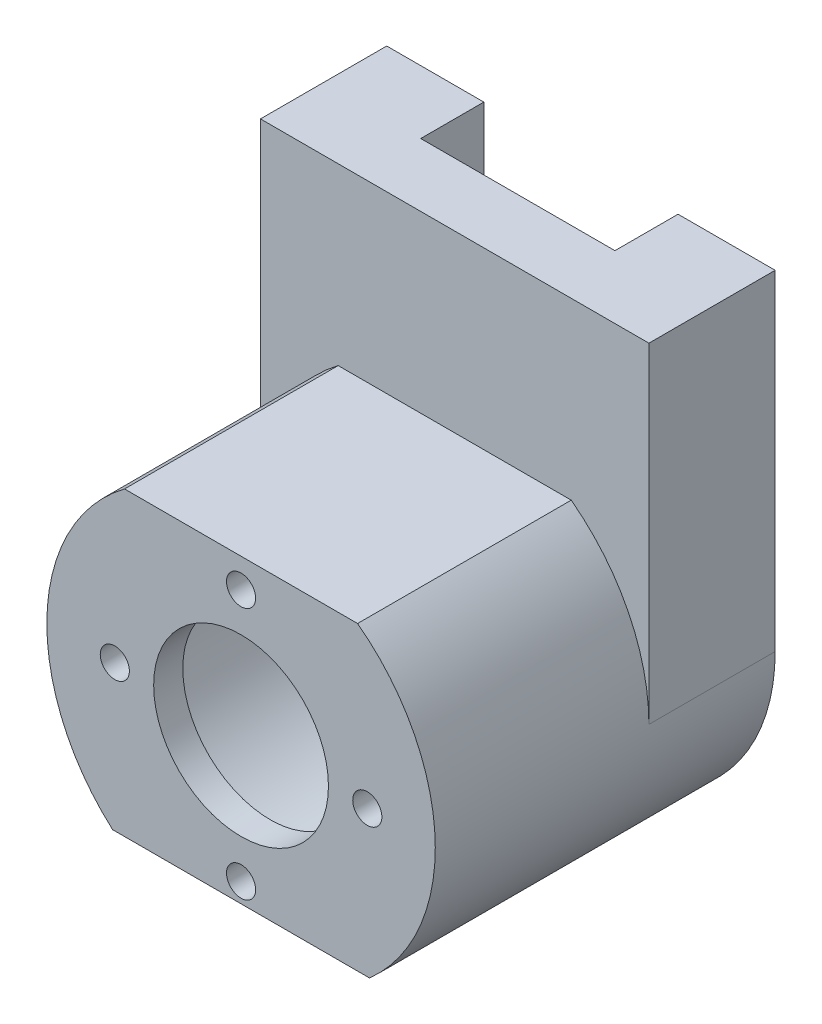
ISO-10303-21;
HEADER;
FILE_DESCRIPTION(('STEP AP214'),'2;1');
FILE_NAME('part.step','',(''),(''),'','','');
FILE_SCHEMA(('AUTOMOTIVE_DESIGN { 1 0 10303 214 1 1 1 1 }'));
ENDSEC;
DATA;
#1=APPLICATION_CONTEXT('core data for automotive mechanical design processes');
#2=APPLICATION_PROTOCOL_DEFINITION('international standard','automotive_design',2000,#1);
#3=PRODUCT_CONTEXT('',#1,'mechanical');
#4=PRODUCT('Part','Part','',(#3));
#5=PRODUCT_RELATED_PRODUCT_CATEGORY('part','',(#4));
#6=PRODUCT_DEFINITION_FORMATION('','',#4);
#7=PRODUCT_DEFINITION_CONTEXT('part definition',#1,'design');
#8=PRODUCT_DEFINITION('design','',#6,#7);
#9=PRODUCT_DEFINITION_SHAPE('','',#8);
#10=(LENGTH_UNIT() NAMED_UNIT(*) SI_UNIT(.MILLI.,.METRE.));
#11=(NAMED_UNIT(*) PLANE_ANGLE_UNIT() SI_UNIT($,.RADIAN.));
#12=(NAMED_UNIT(*) SI_UNIT($,.STERADIAN.) SOLID_ANGLE_UNIT());
#13=UNCERTAINTY_MEASURE_WITH_UNIT(LENGTH_MEASURE(1.E-05),#10,'distance_accuracy_value','');
#14=(GEOMETRIC_REPRESENTATION_CONTEXT(3) GLOBAL_UNCERTAINTY_ASSIGNED_CONTEXT((#13)) GLOBAL_UNIT_ASSIGNED_CONTEXT((#10,
#11,#12)) REPRESENTATION_CONTEXT('',''));
#15=CARTESIAN_POINT('',(0.,0.,0.));
#16=DIRECTION('',(0.,0.,1.));
#17=DIRECTION('',(1.,0.,0.));
#18=AXIS2_PLACEMENT_3D('',#15,#16,#17);
#19=CARTESIAN_POINT('',(0.,-75.,5.));
#20=DIRECTION('',(0.,0.,-1.));
#21=DIRECTION('',(-1.,0.,0.));
#22=AXIS2_PLACEMENT_3D('',#19,#20,#21);
#23=CYLINDRICAL_SURFACE('',#22,20.);
#24=DIRECTION('',(0.,0.,-1.));
#25=VECTOR('',#24,1.);
#26=CARTESIAN_POINT('',(20.,-75.,5.));
#27=LINE('',#26,#25);
#28=CARTESIAN_POINT('',(20.,-74.9999999999886,13.));
#29=VERTEX_POINT('',#28);
#30=CARTESIAN_POINT('',(20.,-75.,0.));
#31=VERTEX_POINT('',#30);
#32=EDGE_CURVE('E150',#29,#31,#27,.T.);
#33=ORIENTED_EDGE('',*,*,#32,.F.);
#34=CARTESIAN_POINT('',(0.,-75.,13.));
#35=DIRECTION('',(0.,0.,1.));
#36=DIRECTION('',(1.,0.,0.));
#37=AXIS2_PLACEMENT_3D('',#34,#35,#36);
#38=CIRCLE('',#37,20.);
#39=CARTESIAN_POINT('',(12.,-59.0000000000259,13.));
#40=VERTEX_POINT('',#39);
#41=EDGE_CURVE('E193',#40,#29,#38,.F.);
#42=ORIENTED_EDGE('',*,*,#41,.F.);
#43=DIRECTION('',(0.,0.,-1.));
#44=VECTOR('',#43,1.);
#45=CARTESIAN_POINT('',(12.,-59.,35.));
#46=LINE('',#45,#44);
#47=CARTESIAN_POINT('',(12.,-59.,35.));
#48=VERTEX_POINT('',#47);
#49=EDGE_CURVE('E137',#48,#40,#46,.T.);
#50=ORIENTED_EDGE('',*,*,#49,.F.);
#51=CARTESIAN_POINT('',(0.,-75.,35.));
#52=DIRECTION('',(0.,0.,1.));
#53=DIRECTION('',(1.,0.,0.));
#54=AXIS2_PLACEMENT_3D('',#51,#52,#53);
#55=CIRCLE('',#54,20.);
#56=CARTESIAN_POINT('',(13.228756555323,-90.,35.));
#57=VERTEX_POINT('',#56);
#58=EDGE_CURVE('E177',#57,#48,#55,.T.);
#59=ORIENTED_EDGE('',*,*,#58,.F.);
#60=CARTESIAN_POINT('',(0.,-75.,50.));
#61=DIRECTION('',(0.,0.707106781186547,-0.707106781186548));
#62=DIRECTION('',(0.,-0.707106781186548,-0.707106781186547));
#63=AXIS2_PLACEMENT_3D('',#60,#61,#62);
#64=ELLIPSE('',#63,28.2842712474619,20.);
#65=CARTESIAN_POINT('',(-13.228756555323,-90.,35.));
#66=VERTEX_POINT('',#65);
#67=EDGE_CURVE('E53',#57,#66,#64,.T.);
#68=ORIENTED_EDGE('',*,*,#67,.T.);
#69=CARTESIAN_POINT('',(-12.,-59.,35.));
#70=VERTEX_POINT('',#69);
#71=EDGE_CURVE('E169',#70,#66,#55,.T.);
#72=ORIENTED_EDGE('',*,*,#71,.F.);
#73=DIRECTION('',(0.,0.,-1.));
#74=VECTOR('',#73,1.);
#75=CARTESIAN_POINT('',(-12.,-59.,35.));
#76=LINE('',#75,#74);
#77=CARTESIAN_POINT('',(-12.,-59.,13.));
#78=VERTEX_POINT('',#77);
#79=EDGE_CURVE('E142',#70,#78,#76,.T.);
#80=ORIENTED_EDGE('',*,*,#79,.T.);
#81=CARTESIAN_POINT('',(-20.,-75.,13.));
#82=VERTEX_POINT('',#81);
#83=EDGE_CURVE('E184',#82,#78,#38,.F.);
#84=ORIENTED_EDGE('',*,*,#83,.F.);
#85=DIRECTION('',(0.,0.,-1.));
#86=VECTOR('',#85,1.);
#87=CARTESIAN_POINT('',(-20.,-75.,5.));
#88=LINE('',#87,#86);
#89=CARTESIAN_POINT('',(-20.,-75.,0.));
#90=VERTEX_POINT('',#89);
#91=EDGE_CURVE('E153',#82,#90,#88,.T.);
#92=ORIENTED_EDGE('',*,*,#91,.T.);
#93=CARTESIAN_POINT('',(0.,-75.,0.));
#94=DIRECTION('',(0.,0.,1.));
#95=DIRECTION('',(1.,0.,0.));
#96=AXIS2_PLACEMENT_3D('',#93,#94,#95);
#97=CIRCLE('',#96,20.);
#98=EDGE_CURVE('E139',#90,#31,#97,.T.);
#99=ORIENTED_EDGE('',*,*,#98,.T.);
#100=EDGE_LOOP('',(#33,#42,#50,#59,#68,#72,#80,#84,#92,#99));
#101=FACE_BOUND('',#100,.T.);
#102=ADVANCED_FACE('F31',(#101),#23,.T.);
#103=CARTESIAN_POINT('',(0.,-75.,35.));
#104=DIRECTION('',(0.,0.,-1.));
#105=DIRECTION('',(-1.,0.,0.));
#106=AXIS2_PLACEMENT_3D('',#103,#104,#105);
#107=CYLINDRICAL_SURFACE('',#106,8.99999999999999);
#108=CARTESIAN_POINT('',(0.,-75.,35.));
#109=DIRECTION('',(0.,0.,1.));
#110=DIRECTION('',(1.,0.,0.));
#111=AXIS2_PLACEMENT_3D('',#108,#109,#110);
#112=CIRCLE('',#111,8.99999999999999);
#113=CARTESIAN_POINT('',(8.99999999999999,-75.,35.));
#114=VERTEX_POINT('',#113);
#115=EDGE_CURVE('E180',#114,#114,#112,.T.);
#116=ORIENTED_EDGE('',*,*,#115,.T.);
#117=EDGE_LOOP('',(#116));
#118=FACE_BOUND('',#117,.T.);
#119=CARTESIAN_POINT('',(0.,-75.,32.));
#120=DIRECTION('',(0.,0.,-1.));
#121=DIRECTION('',(-1.,0.,0.));
#122=AXIS2_PLACEMENT_3D('',#119,#120,#121);
#123=CIRCLE('',#122,8.99999999999999);
#124=CARTESIAN_POINT('',(-8.99999999999999,-75.,32.));
#125=VERTEX_POINT('',#124);
#126=EDGE_CURVE('E224',#125,#125,#123,.T.);
#127=ORIENTED_EDGE('',*,*,#126,.T.);
#128=EDGE_LOOP('',(#127));
#129=FACE_BOUND('',#128,.T.);
#130=ADVANCED_FACE('F242',(#118,#129),#107,.F.);
#131=CARTESIAN_POINT('',(0.,-62.,35.));
#132=DIRECTION('',(0.,0.,-1.));
#133=DIRECTION('',(-1.,0.,0.));
#134=AXIS2_PLACEMENT_3D('',#131,#132,#133);
#135=CYLINDRICAL_SURFACE('',#134,1.5);
#136=CARTESIAN_POINT('',(0.,-62.,35.));
#137=DIRECTION('',(0.,0.,1.));
#138=DIRECTION('',(1.,0.,0.));
#139=AXIS2_PLACEMENT_3D('',#136,#137,#138);
#140=CIRCLE('',#139,1.5);
#141=CARTESIAN_POINT('',(1.5,-62.,35.));
#142=VERTEX_POINT('',#141);
#143=EDGE_CURVE('E235',#142,#142,#140,.T.);
#144=ORIENTED_EDGE('',*,*,#143,.T.);
#145=EDGE_LOOP('',(#144));
#146=FACE_BOUND('',#145,.T.);
#147=CARTESIAN_POINT('',(0.,-62.,32.));
#148=DIRECTION('',(0.,0.,-1.));
#149=DIRECTION('',(-1.,0.,0.));
#150=AXIS2_PLACEMENT_3D('',#147,#148,#149);
#151=CIRCLE('',#150,1.5);
#152=CARTESIAN_POINT('',(-1.5,-62.,32.));
#153=VERTEX_POINT('',#152);
#154=EDGE_CURVE('E221',#153,#153,#151,.T.);
#155=ORIENTED_EDGE('',*,*,#154,.T.);
#156=EDGE_LOOP('',(#155));
#157=FACE_BOUND('',#156,.T.);
#158=ADVANCED_FACE('F279',(#146,#157),#135,.F.);
#159=CARTESIAN_POINT('',(0.,-88.,35.));
#160=DIRECTION('',(0.,0.,-1.));
#161=DIRECTION('',(-1.,0.,0.));
#162=AXIS2_PLACEMENT_3D('',#159,#160,#161);
#163=CYLINDRICAL_SURFACE('',#162,1.5);
#164=CARTESIAN_POINT('',(0.,-88.,35.));
#165=DIRECTION('',(0.,0.,1.));
#166=DIRECTION('',(1.,0.,0.));
#167=AXIS2_PLACEMENT_3D('',#164,#165,#166);
#168=CIRCLE('',#167,1.5);
#169=CARTESIAN_POINT('',(1.5,-88.,35.));
#170=VERTEX_POINT('',#169);
#171=EDGE_CURVE('E233',#170,#170,#168,.T.);
#172=ORIENTED_EDGE('',*,*,#171,.T.);
#173=EDGE_LOOP('',(#172));
#174=FACE_BOUND('',#173,.T.);
#175=CARTESIAN_POINT('',(0.,-88.,32.));
#176=DIRECTION('',(0.,0.,-1.));
#177=DIRECTION('',(-1.,0.,0.));
#178=AXIS2_PLACEMENT_3D('',#175,#176,#177);
#179=CIRCLE('',#178,1.5);
#180=CARTESIAN_POINT('',(-1.5,-88.,32.));
#181=VERTEX_POINT('',#180);
#182=EDGE_CURVE('E218',#181,#181,#179,.T.);
#183=ORIENTED_EDGE('',*,*,#182,.T.);
#184=EDGE_LOOP('',(#183));
#185=FACE_BOUND('',#184,.T.);
#186=ADVANCED_FACE('F332',(#174,#185),#163,.F.);
#187=CARTESIAN_POINT('',(-13.,-75.,35.));
#188=DIRECTION('',(0.,0.,-1.));
#189=DIRECTION('',(-1.,0.,0.));
#190=AXIS2_PLACEMENT_3D('',#187,#188,#189);
#191=CYLINDRICAL_SURFACE('',#190,1.5);
#192=CARTESIAN_POINT('',(-13.,-75.,35.));
#193=DIRECTION('',(0.,0.,1.));
#194=DIRECTION('',(1.,0.,0.));
#195=AXIS2_PLACEMENT_3D('',#192,#193,#194);
#196=CIRCLE('',#195,1.5);
#197=CARTESIAN_POINT('',(-11.5,-75.,35.));
#198=VERTEX_POINT('',#197);
#199=EDGE_CURVE('E230',#198,#198,#196,.T.);
#200=ORIENTED_EDGE('',*,*,#199,.T.);
#201=EDGE_LOOP('',(#200));
#202=FACE_BOUND('',#201,.T.);
#203=CARTESIAN_POINT('',(-13.,-75.,32.));
#204=DIRECTION('',(0.,0.,-1.));
#205=DIRECTION('',(-1.,0.,0.));
#206=AXIS2_PLACEMENT_3D('',#203,#204,#205);
#207=CIRCLE('',#206,1.5);
#208=CARTESIAN_POINT('',(-14.5,-75.,32.));
#209=VERTEX_POINT('',#208);
#210=EDGE_CURVE('E162',#209,#209,#207,.T.);
#211=ORIENTED_EDGE('',*,*,#210,.T.);
#212=EDGE_LOOP('',(#211));
#213=FACE_BOUND('',#212,.T.);
#214=ADVANCED_FACE('F255',(#202,#213),#191,.F.);
#215=CARTESIAN_POINT('',(13.,-75.,35.));
#216=DIRECTION('',(0.,0.,-1.));
#217=DIRECTION('',(-1.,0.,0.));
#218=AXIS2_PLACEMENT_3D('',#215,#216,#217);
#219=CYLINDRICAL_SURFACE('',#218,1.5);
#220=CARTESIAN_POINT('',(13.,-75.,35.));
#221=DIRECTION('',(0.,0.,1.));
#222=DIRECTION('',(1.,0.,0.));
#223=AXIS2_PLACEMENT_3D('',#220,#221,#222);
#224=CIRCLE('',#223,1.5);
#225=CARTESIAN_POINT('',(14.5,-75.,35.));
#226=VERTEX_POINT('',#225);
#227=EDGE_CURVE('E227',#226,#226,#224,.T.);
#228=ORIENTED_EDGE('',*,*,#227,.T.);
#229=EDGE_LOOP('',(#228));
#230=FACE_BOUND('',#229,.T.);
#231=CARTESIAN_POINT('',(13.,-75.,32.));
#232=DIRECTION('',(0.,0.,-1.));
#233=DIRECTION('',(-1.,0.,0.));
#234=AXIS2_PLACEMENT_3D('',#231,#232,#233);
#235=CIRCLE('',#234,1.5);
#236=CARTESIAN_POINT('',(11.5,-75.,32.));
#237=VERTEX_POINT('',#236);
#238=EDGE_CURVE('E160',#237,#237,#235,.T.);
#239=ORIENTED_EDGE('',*,*,#238,.T.);
#240=EDGE_LOOP('',(#239));
#241=FACE_BOUND('',#240,.T.);
#242=ADVANCED_FACE('F252',(#230,#241),#219,.F.);
#243=CARTESIAN_POINT('',(0.,-20.,0.));
#244=DIRECTION('',(0.,0.,1.));
#245=DIRECTION('',(1.,0.,0.));
#246=AXIS2_PLACEMENT_3D('',#243,#244,#245);
#247=PLANE('',#246);
#248=DIRECTION('',(1.,0.,0.));
#249=VECTOR('',#248,1.);
#250=CARTESIAN_POINT('',(0.,-41.,0.));
#251=LINE('',#250,#249);
#252=CARTESIAN_POINT('',(-20.,-41.,0.));
#253=VERTEX_POINT('',#252);
#254=CARTESIAN_POINT('',(-10.,-41.,0.));
#255=VERTEX_POINT('',#254);
#256=EDGE_CURVE('E211',#253,#255,#251,.T.);
#257=ORIENTED_EDGE('',*,*,#256,.T.);
#258=DIRECTION('',(0.,1.,0.));
#259=VECTOR('',#258,1.);
#260=CARTESIAN_POINT('',(-10.,-95.001,0.));
#261=LINE('',#260,#259);
#262=CARTESIAN_POINT('',(-9.99999999999999,-63.819660112501,0.));
#263=VERTEX_POINT('',#262);
#264=EDGE_CURVE('E122',#263,#255,#261,.T.);
#265=ORIENTED_EDGE('',*,*,#264,.F.);
#266=CARTESIAN_POINT('',(0.,-75.,0.));
#267=DIRECTION('',(0.,0.,1.));
#268=DIRECTION('',(1.,0.,0.));
#269=AXIS2_PLACEMENT_3D('',#266,#267,#268);
#270=CIRCLE('',#269,15.);
#271=CARTESIAN_POINT('',(10.,-63.819660112501,0.));
#272=VERTEX_POINT('',#271);
#273=EDGE_CURVE('E130',#263,#272,#270,.T.);
#274=ORIENTED_EDGE('',*,*,#273,.T.);
#275=DIRECTION('',(0.,1.,0.));
#276=VECTOR('',#275,1.);
#277=CARTESIAN_POINT('',(10.,-95.001,0.));
#278=LINE('',#277,#276);
#279=CARTESIAN_POINT('',(10.,-41.,0.));
#280=VERTEX_POINT('',#279);
#281=EDGE_CURVE('E113',#272,#280,#278,.T.);
#282=ORIENTED_EDGE('',*,*,#281,.T.);
#283=CARTESIAN_POINT('',(20.,-41.,0.));
#284=VERTEX_POINT('',#283);
#285=EDGE_CURVE('E210',#280,#284,#251,.T.);
#286=ORIENTED_EDGE('',*,*,#285,.T.);
#287=DIRECTION('',(0.,1.,0.));
#288=VECTOR('',#287,1.);
#289=CARTESIAN_POINT('',(20.,-20.,0.));
#290=LINE('',#289,#288);
#291=EDGE_CURVE('E147',#31,#284,#290,.T.);
#292=ORIENTED_EDGE('',*,*,#291,.F.);
#293=ORIENTED_EDGE('',*,*,#98,.F.);
#294=DIRECTION('',(0.,-1.,0.));
#295=VECTOR('',#294,1.);
#296=CARTESIAN_POINT('',(-20.,-20.,0.));
#297=LINE('',#296,#295);
#298=EDGE_CURVE('E136',#253,#90,#297,.T.);
#299=ORIENTED_EDGE('',*,*,#298,.F.);
#300=EDGE_LOOP('',(#257,#265,#274,#282,#286,#292,#293,#299));
#301=FACE_BOUND('',#300,.T.);
#302=ADVANCED_FACE('F135',(#301),#247,.F.);
#303=CARTESIAN_POINT('',(-20.,-20.,5.));
#304=DIRECTION('',(1.,0.,0.));
#305=DIRECTION('',(0.,1.,0.));
#306=AXIS2_PLACEMENT_3D('',#303,#304,#305);
#307=PLANE('',#306);
#308=ORIENTED_EDGE('',*,*,#91,.F.);
#309=DIRECTION('',(0.,1.,0.));
#310=VECTOR('',#309,1.);
#311=CARTESIAN_POINT('',(-20.,-500000.,13.));
#312=LINE('',#311,#310);
#313=CARTESIAN_POINT('',(-20.,-41.,13.));
#314=VERTEX_POINT('',#313);
#315=EDGE_CURVE('E195',#82,#314,#312,.T.);
#316=ORIENTED_EDGE('',*,*,#315,.T.);
#317=DIRECTION('',(0.,0.,1.));
#318=VECTOR('',#317,1.);
#319=CARTESIAN_POINT('',(-20.,-41.,-5.));
#320=LINE('',#319,#318);
#321=EDGE_CURVE('E202',#253,#314,#320,.T.);
#322=ORIENTED_EDGE('',*,*,#321,.F.);
#323=ORIENTED_EDGE('',*,*,#298,.T.);
#324=EDGE_LOOP('',(#308,#316,#322,#323));
#325=FACE_BOUND('',#324,.T.);
#326=ADVANCED_FACE('F33',(#325),#307,.F.);
#327=CARTESIAN_POINT('',(20.,-20.,5.));
#328=DIRECTION('',(-1.,0.,0.));
#329=DIRECTION('',(0.,-1.,0.));
#330=AXIS2_PLACEMENT_3D('',#327,#328,#329);
#331=PLANE('',#330);
#332=ORIENTED_EDGE('',*,*,#291,.T.);
#333=DIRECTION('',(0.,0.,1.));
#334=VECTOR('',#333,1.);
#335=CARTESIAN_POINT('',(20.,-41.,5.));
#336=LINE('',#335,#334);
#337=CARTESIAN_POINT('',(20.,-41.,13.));
#338=VERTEX_POINT('',#337);
#339=EDGE_CURVE('E11',#284,#338,#336,.T.);
#340=ORIENTED_EDGE('',*,*,#339,.T.);
#341=DIRECTION('',(0.,1.,0.));
#342=VECTOR('',#341,1.);
#343=CARTESIAN_POINT('',(20.,-500000.,13.));
#344=LINE('',#343,#342);
#345=EDGE_CURVE('E203',#29,#338,#344,.T.);
#346=ORIENTED_EDGE('',*,*,#345,.F.);
#347=ORIENTED_EDGE('',*,*,#32,.T.);
#348=EDGE_LOOP('',(#332,#340,#346,#347));
#349=FACE_BOUND('',#348,.T.);
#350=ADVANCED_FACE('F266',(#349),#331,.F.);
#351=CARTESIAN_POINT('',(0.,-75.,5.));
#352=DIRECTION('',(0.,0.,-1.));
#353=DIRECTION('',(-1.,0.,0.));
#354=AXIS2_PLACEMENT_3D('',#351,#352,#353);
#355=CYLINDRICAL_SURFACE('',#354,15.);
#356=DIRECTION('',(0.,0.,-1.));
#357=VECTOR('',#356,1.);
#358=CARTESIAN_POINT('',(-9.99999999999999,-63.819660112501,5.));
#359=LINE('',#358,#357);
#360=CARTESIAN_POINT('',(-9.99999999999999,-63.819660112501,6.5));
#361=VERTEX_POINT('',#360);
#362=EDGE_CURVE('E312',#263,#361,#359,.F.);
#363=ORIENTED_EDGE('',*,*,#362,.T.);
#364=CARTESIAN_POINT('',(0.,-75.,6.5));
#365=DIRECTION('',(0.,0.,1.));
#366=DIRECTION('',(1.,0.,0.));
#367=AXIS2_PLACEMENT_3D('',#364,#365,#366);
#368=CIRCLE('',#367,15.);
#369=CARTESIAN_POINT('',(10.,-63.819660112501,6.5));
#370=VERTEX_POINT('',#369);
#371=EDGE_CURVE('E131',#361,#370,#368,.F.);
#372=ORIENTED_EDGE('',*,*,#371,.T.);
#373=DIRECTION('',(0.,0.,-1.));
#374=VECTOR('',#373,1.);
#375=CARTESIAN_POINT('',(10.,-63.819660112501,5.));
#376=LINE('',#375,#374);
#377=EDGE_CURVE('E116',#370,#272,#376,.T.);
#378=ORIENTED_EDGE('',*,*,#377,.T.);
#379=ORIENTED_EDGE('',*,*,#273,.F.);
#380=EDGE_LOOP('',(#363,#372,#378,#379));
#381=FACE_BOUND('',#380,.T.);
#382=CARTESIAN_POINT('',(0.,-75.,32.));
#383=DIRECTION('',(0.,0.,-1.));
#384=DIRECTION('',(-1.,0.,0.));
#385=AXIS2_PLACEMENT_3D('',#382,#383,#384);
#386=CIRCLE('',#385,15.);
#387=CARTESIAN_POINT('',(-15.,-75.,32.));
#388=VERTEX_POINT('',#387);
#389=EDGE_CURVE('E163',#388,#388,#386,.T.);
#390=ORIENTED_EDGE('',*,*,#389,.F.);
#391=EDGE_LOOP('',(#390));
#392=FACE_BOUND('',#391,.T.);
#393=ADVANCED_FACE('F128',(#381,#392),#355,.F.);
#394=CARTESIAN_POINT('',(0.,-75.,35.));
#395=DIRECTION('',(0.,0.,1.));
#396=DIRECTION('',(1.,0.,0.));
#397=AXIS2_PLACEMENT_3D('',#394,#395,#396);
#398=PLANE('',#397);
#399=DIRECTION('',(-1.,0.,0.));
#400=VECTOR('',#399,1.);
#401=CARTESIAN_POINT('',(0.,-90.,35.));
#402=LINE('',#401,#400);
#403=EDGE_CURVE('E39',#57,#66,#402,.T.);
#404=ORIENTED_EDGE('',*,*,#403,.F.);
#405=ORIENTED_EDGE('',*,*,#58,.T.);
#406=DIRECTION('',(-1.,0.,0.));
#407=VECTOR('',#406,1.);
#408=CARTESIAN_POINT('',(12.,-59.,35.));
#409=LINE('',#408,#407);
#410=EDGE_CURVE('E173',#48,#70,#409,.T.);
#411=ORIENTED_EDGE('',*,*,#410,.T.);
#412=ORIENTED_EDGE('',*,*,#71,.T.);
#413=EDGE_LOOP('',(#404,#405,#411,#412));
#414=FACE_BOUND('',#413,.T.);
#415=ORIENTED_EDGE('',*,*,#199,.F.);
#416=EDGE_LOOP('',(#415));
#417=FACE_BOUND('',#416,.T.);
#418=ORIENTED_EDGE('',*,*,#143,.F.);
#419=EDGE_LOOP('',(#418));
#420=FACE_BOUND('',#419,.T.);
#421=ORIENTED_EDGE('',*,*,#115,.F.);
#422=EDGE_LOOP('',(#421));
#423=FACE_BOUND('',#422,.T.);
#424=ORIENTED_EDGE('',*,*,#171,.F.);
#425=EDGE_LOOP('',(#424));
#426=FACE_BOUND('',#425,.T.);
#427=ORIENTED_EDGE('',*,*,#227,.F.);
#428=EDGE_LOOP('',(#427));
#429=FACE_BOUND('',#428,.T.);
#430=ADVANCED_FACE('F170',(#414,#417,#420,#423,#426,#429),#398,.T.);
#431=CARTESIAN_POINT('',(12.,-59.,35.));
#432=DIRECTION('',(0.,-1.,0.));
#433=DIRECTION('',(1.,0.,0.));
#434=AXIS2_PLACEMENT_3D('',#431,#432,#433);
#435=PLANE('',#434);
#436=ORIENTED_EDGE('',*,*,#49,.T.);
#437=DIRECTION('',(1.,0.,0.));
#438=VECTOR('',#437,1.);
#439=CARTESIAN_POINT('',(-20.0000000001445,-59.0000000000259,13.));
#440=LINE('',#439,#438);
#441=EDGE_CURVE('E189',#78,#40,#440,.T.);
#442=ORIENTED_EDGE('',*,*,#441,.F.);
#443=ORIENTED_EDGE('',*,*,#79,.F.);
#444=ORIENTED_EDGE('',*,*,#410,.F.);
#445=EDGE_LOOP('',(#436,#442,#443,#444));
#446=FACE_BOUND('',#445,.T.);
#447=ADVANCED_FACE('F187',(#446),#435,.F.);
#448=CARTESIAN_POINT('',(0.,-75.,32.));
#449=DIRECTION('',(0.,0.,-1.));
#450=DIRECTION('',(-1.,0.,0.));
#451=AXIS2_PLACEMENT_3D('',#448,#449,#450);
#452=PLANE('',#451);
#453=ORIENTED_EDGE('',*,*,#126,.F.);
#454=EDGE_LOOP('',(#453));
#455=FACE_BOUND('',#454,.T.);
#456=ORIENTED_EDGE('',*,*,#154,.F.);
#457=EDGE_LOOP('',(#456));
#458=FACE_BOUND('',#457,.T.);
#459=ORIENTED_EDGE('',*,*,#182,.F.);
#460=EDGE_LOOP('',(#459));
#461=FACE_BOUND('',#460,.T.);
#462=ORIENTED_EDGE('',*,*,#210,.F.);
#463=EDGE_LOOP('',(#462));
#464=FACE_BOUND('',#463,.T.);
#465=ORIENTED_EDGE('',*,*,#238,.F.);
#466=EDGE_LOOP('',(#465));
#467=FACE_BOUND('',#466,.T.);
#468=ORIENTED_EDGE('',*,*,#389,.T.);
#469=EDGE_LOOP('',(#468));
#470=FACE_BOUND('',#469,.T.);
#471=ADVANCED_FACE('F259',(#455,#458,#461,#464,#467,#470),#452,.T.);
#472=CARTESIAN_POINT('',(-20.00005,-90.,35.));
#473=DIRECTION('',(0.,0.707106781186547,-0.707106781186548));
#474=DIRECTION('',(0.,0.707106781186548,0.707106781186547));
#475=AXIS2_PLACEMENT_3D('',#472,#473,#474);
#476=PLANE('',#475);
#477=ORIENTED_EDGE('',*,*,#67,.F.);
#478=ORIENTED_EDGE('',*,*,#403,.T.);
#479=EDGE_LOOP('',(#477,#478));
#480=FACE_BOUND('',#479,.T.);
#481=ADVANCED_FACE('F165',(#480),#476,.F.);
#482=CARTESIAN_POINT('',(20.,-41.,-5.));
#483=DIRECTION('',(0.,-1.,0.));
#484=DIRECTION('',(0.,0.,-1.));
#485=AXIS2_PLACEMENT_3D('',#482,#483,#484);
#486=PLANE('',#485);
#487=DIRECTION('',(1.,0.,0.));
#488=VECTOR('',#487,1.);
#489=CARTESIAN_POINT('',(10.,-41.,6.5));
#490=LINE('',#489,#488);
#491=CARTESIAN_POINT('',(-10.,-41.,6.5));
#492=VERTEX_POINT('',#491);
#493=CARTESIAN_POINT('',(10.,-41.,6.5));
#494=VERTEX_POINT('',#493);
#495=EDGE_CURVE('E46',#492,#494,#490,.T.);
#496=ORIENTED_EDGE('',*,*,#495,.F.);
#497=DIRECTION('',(0.,0.,1.));
#498=VECTOR('',#497,1.);
#499=CARTESIAN_POINT('',(-10.,-41.,6.5));
#500=LINE('',#499,#498);
#501=EDGE_CURVE('E300',#255,#492,#500,.T.);
#502=ORIENTED_EDGE('',*,*,#501,.F.);
#503=ORIENTED_EDGE('',*,*,#256,.F.);
#504=ORIENTED_EDGE('',*,*,#321,.T.);
#505=DIRECTION('',(1.,0.,0.));
#506=VECTOR('',#505,1.);
#507=CARTESIAN_POINT('',(-20.,-41.,13.));
#508=LINE('',#507,#506);
#509=EDGE_CURVE('E200',#314,#338,#508,.T.);
#510=ORIENTED_EDGE('',*,*,#509,.T.);
#511=ORIENTED_EDGE('',*,*,#339,.F.);
#512=ORIENTED_EDGE('',*,*,#285,.F.);
#513=DIRECTION('',(0.,0.,-1.));
#514=VECTOR('',#513,1.);
#515=CARTESIAN_POINT('',(10.,-41.,0.));
#516=LINE('',#515,#514);
#517=EDGE_CURVE('E118',#494,#280,#516,.T.);
#518=ORIENTED_EDGE('',*,*,#517,.F.);
#519=EDGE_LOOP('',(#496,#502,#503,#504,#510,#511,#512,#518));
#520=FACE_BOUND('',#519,.T.);
#521=ADVANCED_FACE('F297',(#520),#486,.F.);
#522=CARTESIAN_POINT('',(-20.,-500000.,13.));
#523=DIRECTION('',(0.,0.,1.));
#524=DIRECTION('',(1.,0.,0.));
#525=AXIS2_PLACEMENT_3D('',#522,#523,#524);
#526=PLANE('',#525);
#527=ORIENTED_EDGE('',*,*,#441,.T.);
#528=ORIENTED_EDGE('',*,*,#41,.T.);
#529=ORIENTED_EDGE('',*,*,#345,.T.);
#530=ORIENTED_EDGE('',*,*,#509,.F.);
#531=ORIENTED_EDGE('',*,*,#315,.F.);
#532=ORIENTED_EDGE('',*,*,#83,.T.);
#533=EDGE_LOOP('',(#527,#528,#529,#530,#531,#532));
#534=FACE_BOUND('',#533,.T.);
#535=ADVANCED_FACE('F293',(#534),#526,.T.);
#536=CARTESIAN_POINT('',(-10.,-95.001,6.5));
#537=DIRECTION('',(-1.,0.,0.));
#538=DIRECTION('',(0.,0.,1.));
#539=AXIS2_PLACEMENT_3D('',#536,#537,#538);
#540=PLANE('',#539);
#541=ORIENTED_EDGE('',*,*,#264,.T.);
#542=ORIENTED_EDGE('',*,*,#501,.T.);
#543=DIRECTION('',(0.,1.,0.));
#544=VECTOR('',#543,1.);
#545=CARTESIAN_POINT('',(-10.,-95.001,6.5));
#546=LINE('',#545,#544);
#547=EDGE_CURVE('E308',#361,#492,#546,.T.);
#548=ORIENTED_EDGE('',*,*,#547,.F.);
#549=ORIENTED_EDGE('',*,*,#362,.F.);
#550=EDGE_LOOP('',(#541,#542,#548,#549));
#551=FACE_BOUND('',#550,.T.);
#552=ADVANCED_FACE('F310',(#551),#540,.F.);
#553=CARTESIAN_POINT('',(10.,-95.001,6.5));
#554=DIRECTION('',(0.,0.,1.));
#555=DIRECTION('',(1.,0.,0.));
#556=AXIS2_PLACEMENT_3D('',#553,#554,#555);
#557=PLANE('',#556);
#558=ORIENTED_EDGE('',*,*,#547,.T.);
#559=ORIENTED_EDGE('',*,*,#495,.T.);
#560=DIRECTION('',(0.,1.,0.));
#561=VECTOR('',#560,1.);
#562=CARTESIAN_POINT('',(10.,-95.001,6.5));
#563=LINE('',#562,#561);
#564=EDGE_CURVE('E197',#370,#494,#563,.T.);
#565=ORIENTED_EDGE('',*,*,#564,.F.);
#566=ORIENTED_EDGE('',*,*,#371,.F.);
#567=EDGE_LOOP('',(#558,#559,#565,#566));
#568=FACE_BOUND('',#567,.T.);
#569=ADVANCED_FACE('F314',(#568),#557,.F.);
#570=CARTESIAN_POINT('',(10.,-95.001,0.));
#571=DIRECTION('',(1.,0.,0.));
#572=DIRECTION('',(0.,0.,-1.));
#573=AXIS2_PLACEMENT_3D('',#570,#571,#572);
#574=PLANE('',#573);
#575=ORIENTED_EDGE('',*,*,#564,.T.);
#576=ORIENTED_EDGE('',*,*,#517,.T.);
#577=ORIENTED_EDGE('',*,*,#281,.F.);
#578=ORIENTED_EDGE('',*,*,#377,.F.);
#579=EDGE_LOOP('',(#575,#576,#577,#578));
#580=FACE_BOUND('',#579,.T.);
#581=ADVANCED_FACE('F115',(#580),#574,.F.);
#582=CLOSED_SHELL('',(#102,#130,#158,#186,#214,#242,#302,#326,#350,#393,#430,#447,#471,#481,
#521,#535,#552,#569,#581));
#583=MANIFOLD_SOLID_BREP('B2',#582);
#584=ADVANCED_BREP_SHAPE_REPRESENTATION('',(#18,#583),#14);
#585=SHAPE_DEFINITION_REPRESENTATION(#9,#584);
ENDSEC;
END-ISO-10303-21;
